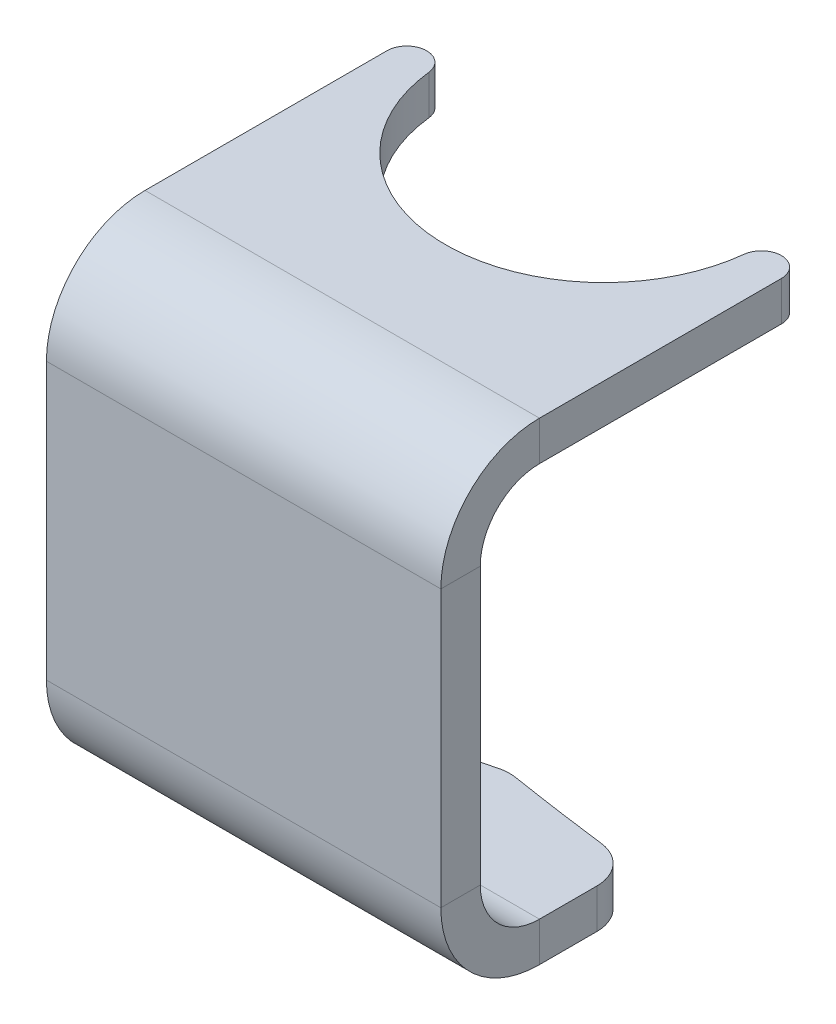
ISO-10303-21;
HEADER;
FILE_DESCRIPTION(('STEP AP214'),'2;1');
FILE_NAME('part.step','',(''),(''),'','','');
FILE_SCHEMA(('AUTOMOTIVE_DESIGN { 1 0 10303 214 1 1 1 1 }'));
ENDSEC;
DATA;
#1=APPLICATION_CONTEXT('core data for automotive mechanical design processes');
#2=APPLICATION_PROTOCOL_DEFINITION('international standard','automotive_design',2000,#1);
#3=PRODUCT_CONTEXT('',#1,'mechanical');
#4=PRODUCT('Part','Part','',(#3));
#5=PRODUCT_RELATED_PRODUCT_CATEGORY('part','',(#4));
#6=PRODUCT_DEFINITION_FORMATION('','',#4);
#7=PRODUCT_DEFINITION_CONTEXT('part definition',#1,'design');
#8=PRODUCT_DEFINITION('design','',#6,#7);
#9=PRODUCT_DEFINITION_SHAPE('','',#8);
#10=(LENGTH_UNIT() NAMED_UNIT(*) SI_UNIT(.MILLI.,.METRE.));
#11=(NAMED_UNIT(*) PLANE_ANGLE_UNIT() SI_UNIT($,.RADIAN.));
#12=(NAMED_UNIT(*) SI_UNIT($,.STERADIAN.) SOLID_ANGLE_UNIT());
#13=UNCERTAINTY_MEASURE_WITH_UNIT(LENGTH_MEASURE(1.E-05),#10,'distance_accuracy_value','');
#14=(GEOMETRIC_REPRESENTATION_CONTEXT(3) GLOBAL_UNCERTAINTY_ASSIGNED_CONTEXT((#13)) GLOBAL_UNIT_ASSIGNED_CONTEXT((#10,
#11,#12)) REPRESENTATION_CONTEXT('',''));
#15=CARTESIAN_POINT('',(0.,0.,0.));
#16=DIRECTION('',(0.,0.,1.));
#17=DIRECTION('',(1.,0.,0.));
#18=AXIS2_PLACEMENT_3D('',#15,#16,#17);
#19=CARTESIAN_POINT('',(15.875,15.5575000000001,-52.8094011308138));
#20=CARTESIAN_POINT('',(15.875,15.6633333333336,-52.8094011308149));
#21=CARTESIAN_POINT('',(15.875,15.7691666666666,-52.8094011306934));
#22=CARTESIAN_POINT('',(15.875,16.9333333333345,-52.8094011307177));
#23=CARTESIAN_POINT('',(15.875,17.991666666664,-52.8094011308602));
#24=CARTESIAN_POINT('',(15.875,19.1558333333337,-52.8094011308844));
#25=CARTESIAN_POINT('',(15.875,19.2616666666665,-52.8094011308818));
#26=CARTESIAN_POINT('',(15.875,19.3675000000001,-52.8094011308829));
#27=CARTESIAN_POINT('',(15.8750000000818,15.5575000000001,-55.6845055560318));
#28=CARTESIAN_POINT('',(15.8750000000809,15.6633333333336,-55.6845055560325));
#29=CARTESIAN_POINT('',(15.8750000002235,15.7691666666663,-55.6845055561596));
#30=CARTESIAN_POINT('',(15.8750000001932,16.9333333333043,-55.6845055561313));
#31=CARTESIAN_POINT('',(15.8750000000289,17.991666666664,-55.6845055559849));
#32=CARTESIAN_POINT('',(15.8749999999986,19.1558333333337,-55.6845055559567));
#33=CARTESIAN_POINT('',(15.8750000000014,19.2616666666665,-55.6845055559581));
#34=CARTESIAN_POINT('',(15.8750000000005,19.3675000000001,-55.6845055559585));
#35=CARTESIAN_POINT('',(13.0043748022879,15.5575000000001,-55.8449313320533));
#36=CARTESIAN_POINT('',(13.0043748022864,15.6633333333336,-55.8449313320537));
#37=CARTESIAN_POINT('',(13.004374802209,15.7691666666663,-55.8449313322153));
#38=CARTESIAN_POINT('',(13.0043748022272,16.9333333333043,-55.844931332183));
#39=CARTESIAN_POINT('',(13.0043748023171,17.9916666666622,-55.8449313319905));
#40=CARTESIAN_POINT('',(13.0043748023342,19.1558333333339,-55.8449313319582));
#41=CARTESIAN_POINT('',(13.004374802332,19.2616666666664,-55.8449313319594));
#42=CARTESIAN_POINT('',(13.0043748023331,19.3675000000001,-55.8449313319601));
#43=CARTESIAN_POINT('',(12.6840231163649,15.5575000000001,-52.9877298597671));
#44=CARTESIAN_POINT('',(12.6840231163649,15.6633333333336,-52.9877298597671));
#45=CARTESIAN_POINT('',(12.6840231163542,15.7691666666666,-52.987729859672));
#46=CARTESIAN_POINT('',(12.6840231163565,16.9333333333345,-52.987729859692));
#47=CARTESIAN_POINT('',(12.6840231163689,17.9916666666622,-52.9877298598028));
#48=CARTESIAN_POINT('',(12.6840231163711,19.1558333333339,-52.9877298598229));
#49=CARTESIAN_POINT('',(12.6840231163708,19.2616666666664,-52.9877298598202));
#50=CARTESIAN_POINT('',(12.684023116371,19.3675000000001,-52.9877298598217));
#51=(BOUNDED_SURFACE() B_SPLINE_SURFACE(3,3,((#19,#20,#21,#22,#23,#24,#25,#26),(#27,#28,#29,#30,
#31,#32,#33,#34),(#35,#36,#37,#38,#39,#40,#41,#42),(#43,#44,#45,#46,#47,#48,#49,#50)),
.UNSPECIFIED.,.F.,.F.,.F.) B_SPLINE_SURFACE_WITH_KNOTS((4,4),(4,2,2,4),(0.,1.),
(-0.0999999999999892,0.,1.,1.1),
.UNSPECIFIED.) GEOMETRIC_REPRESENTATION_ITEM() RATIONAL_B_SPLINE_SURFACE(((1.,1.,1.,1.,1.,1.,1.,
1.),(0.370532162132682,0.370532162132682,0.370532162104608,0.370532162116241,0.370532162148339,
0.370532162148339,0.370532162148506,0.370532162148506),(0.370532162132682,0.370532162132682,
0.370532162104608,0.370532162116241,0.370532162148339,0.370532162148339,0.370532162148506,
0.370532162148506),(1.,1.,1.,1.,1.,1.,1.,1.))) REPRESENTATION_ITEM('') SURFACE());
#52=CARTESIAN_POINT('',(12.6840231163649,15.5575000000001,-52.9877298597671));
#53=CARTESIAN_POINT('',(12.6840231163649,15.6633333333336,-52.9877298597671));
#54=CARTESIAN_POINT('',(12.6840231163542,15.7691666666666,-52.987729859672));
#55=CARTESIAN_POINT('',(12.6840231163565,16.9333333333345,-52.987729859692));
#56=CARTESIAN_POINT('',(12.6840231163689,17.9916666666622,-52.9877298598028));
#57=CARTESIAN_POINT('',(12.6840231163711,19.1558333333339,-52.9877298598229));
#58=CARTESIAN_POINT('',(12.6840231163708,19.2616666666664,-52.9877298598202));
#59=CARTESIAN_POINT('',(12.684023116371,19.3675000000001,-52.9877298598217));
#60=(BOUNDED_CURVE() B_SPLINE_CURVE(3,(#52,#53,#54,#55,#56,#57,#58,#59),.UNSPECIFIED.,.F.,
.F.) B_SPLINE_CURVE_WITH_KNOTS((4,2,2,4),(-0.0999999999999892,0.,1.,1.1),
.UNSPECIFIED.) CURVE() GEOMETRIC_REPRESENTATION_ITEM() RATIONAL_B_SPLINE_CURVE((1.,1.,1.,1.,1.,
1.,1.,1.)) REPRESENTATION_ITEM(''));
#61=CARTESIAN_POINT('',(12.6840231163709,19.0500000000001,-52.9877298598211));
#62=VERTEX_POINT('',#61);
#63=CARTESIAN_POINT('',(12.6840231163544,15.8750000000001,-52.9877298596738));
#64=VERTEX_POINT('',#63);
#65=EDGE_CURVE('E500',#62,#64,#60,.F.);
#66=CARTESIAN_POINT('',(12.6840231163709,19.0500000000001,-52.9877298598211));
#67=CARTESIAN_POINT('',(13.0043748023327,19.0500000000001,-55.8449313319611));
#68=CARTESIAN_POINT('',(15.8750000000013,19.0500000000001,-55.6845055559592));
#69=CARTESIAN_POINT('',(15.875,19.0500000000001,-52.8094011308822));
#70=(BOUNDED_CURVE() B_SPLINE_CURVE(3,(#66,#67,#68,#69),.UNSPECIFIED.,.F.,
.F.) B_SPLINE_CURVE_WITH_KNOTS((4,4),(0.,1.),
.UNSPECIFIED.) CURVE() GEOMETRIC_REPRESENTATION_ITEM() RATIONAL_B_SPLINE_CURVE((1.,
0.370532162148339,0.370532162148339,1.)) REPRESENTATION_ITEM(''));
#71=CARTESIAN_POINT('',(15.875,19.0500000000001,-52.8094011308822));
#72=VERTEX_POINT('',#71);
#73=EDGE_CURVE('E496',#72,#62,#70,.F.);
#74=CARTESIAN_POINT('',(15.875,19.3675000000001,-52.8094011308829));
#75=CARTESIAN_POINT('',(15.875,19.2616666666665,-52.8094011308818));
#76=CARTESIAN_POINT('',(15.875,19.1558333333337,-52.8094011308844));
#77=CARTESIAN_POINT('',(15.875,17.991666666664,-52.8094011308602));
#78=CARTESIAN_POINT('',(15.875,16.9333333333345,-52.8094011307177));
#79=CARTESIAN_POINT('',(15.875,15.7691666666666,-52.8094011306934));
#80=CARTESIAN_POINT('',(15.875,15.6633333333336,-52.8094011308149));
#81=CARTESIAN_POINT('',(15.875,15.5575000000001,-52.8094011308138));
#82=(BOUNDED_CURVE() B_SPLINE_CURVE(3,(#74,#75,#76,#77,#78,#79,#80,#81),.UNSPECIFIED.,.F.,
.F.) B_SPLINE_CURVE_WITH_KNOTS((4,2,2,4),(-0.0999999999999892,0.,1.,1.1),
.UNSPECIFIED.) CURVE() GEOMETRIC_REPRESENTATION_ITEM() RATIONAL_B_SPLINE_CURVE((1.,1.,1.,1.,1.,
1.,1.,1.)) REPRESENTATION_ITEM(''));
#83=CARTESIAN_POINT('',(15.875,15.8750000000001,-52.8094011306956));
#84=VERTEX_POINT('',#83);
#85=EDGE_CURVE('E325',#84,#72,#82,.F.);
#86=CARTESIAN_POINT('',(15.875,15.8750000000001,-52.8094011306956));
#87=CARTESIAN_POINT('',(15.8750000002207,15.8750000000001,-55.684505556157));
#88=CARTESIAN_POINT('',(13.0043748022106,15.8750000000001,-55.8449313322124));
#89=CARTESIAN_POINT('',(12.6840231163544,15.8750000000001,-52.9877298596738));
#90=(BOUNDED_CURVE() B_SPLINE_CURVE(3,(#86,#87,#88,#89),.UNSPECIFIED.,.F.,
.F.) B_SPLINE_CURVE_WITH_KNOTS((4,4),(0.,1.),
.UNSPECIFIED.) CURVE() GEOMETRIC_REPRESENTATION_ITEM() RATIONAL_B_SPLINE_CURVE((1.,
0.370532162105666,0.370532162105666,1.)) REPRESENTATION_ITEM(''));
#91=EDGE_CURVE('E488',#64,#84,#90,.F.);
#92=ORIENTED_EDGE('',*,*,#65,.F.);
#93=ORIENTED_EDGE('',*,*,#73,.F.);
#94=ORIENTED_EDGE('',*,*,#85,.F.);
#95=ORIENTED_EDGE('',*,*,#91,.F.);
#96=EDGE_LOOP('',(#92,#93,#94,#95));
#97=FACE_BOUND('',#96,.T.);
#98=ADVANCED_FACE('F87',(#97),#51,.T.);
#99=CARTESIAN_POINT('',(-15.875,19.3675,-52.8094011308833));
#100=CARTESIAN_POINT('',(-15.875,19.2616666666665,-52.8094011308036));
#101=CARTESIAN_POINT('',(-15.875,19.1558333333337,-52.8094011309626));
#102=CARTESIAN_POINT('',(-15.875,17.991666666664,-52.8094011300902));
#103=CARTESIAN_POINT('',(-15.875,16.9333333333363,-52.8094011239826));
#104=CARTESIAN_POINT('',(-15.875,15.7691666666665,-52.8094011231101));
#105=CARTESIAN_POINT('',(-15.875,15.6633333333347,-52.8094011281098));
#106=CARTESIAN_POINT('',(-15.875,15.5575000000006,-52.8094011280305));
#107=CARTESIAN_POINT('',(-15.875,19.3675000000001,-55.6845055559581));
#108=CARTESIAN_POINT('',(-15.8750000000942,19.2616666666665,-55.6845055560385));
#109=CARTESIAN_POINT('',(-15.8749999999069,19.1558333333233,-55.6845055558736));
#110=CARTESIAN_POINT('',(-15.8750000009308,17.9916666656205,-55.6845055568026));
#111=CARTESIAN_POINT('',(-15.8750000081149,16.9333333323012,-55.6845055632712));
#112=CARTESIAN_POINT('',(-15.8750000091388,15.7691666666561,-55.6845055641962));
#113=CARTESIAN_POINT('',(-15.8750000032605,15.6633333333347,-55.6845055588985));
#114=CARTESIAN_POINT('',(-15.8750000033541,15.5575000000006,-55.6845055589815));
#115=CARTESIAN_POINT('',(-13.0043748023334,19.3675000000001,-55.8449313319596));
#116=CARTESIAN_POINT('',(-13.0043748022836,19.2616666666664,-55.844931332065));
#117=CARTESIAN_POINT('',(-13.0043748023865,19.1558333333235,-55.8449313318535));
#118=CARTESIAN_POINT('',(-13.0043748018019,17.9916666656186,-55.8449313330208));
#119=CARTESIAN_POINT('',(-13.0043747978229,16.9333333323012,-55.8449313412512));
#120=CARTESIAN_POINT('',(-13.0043747972504,15.7691666666561,-55.8449313424265));
#121=CARTESIAN_POINT('',(-13.0043748005173,15.6633333333347,-55.8449313356942));
#122=CARTESIAN_POINT('',(-13.0043748004679,15.5575000000006,-55.8449313358011));
#123=CARTESIAN_POINT('',(-12.684023116371,19.3675,-52.987729859822));
#124=CARTESIAN_POINT('',(-12.6840231163641,19.2616666666664,-52.987729859761));
#125=CARTESIAN_POINT('',(-12.6840231163781,19.1558333333339,-52.9877298598855));
#126=CARTESIAN_POINT('',(-12.6840231162998,17.9916666666622,-52.9877298591868));
#127=CARTESIAN_POINT('',(-12.6840231157603,16.9333333333382,-52.9877298543751));
#128=CARTESIAN_POINT('',(-12.6840231156828,15.7691666666663,-52.9877298536843));
#129=CARTESIAN_POINT('',(-12.6840231161253,15.6633333333348,-52.9877298576304));
#130=CARTESIAN_POINT('',(-12.6840231161184,15.5575000000006,-52.9877298575695));
#131=(BOUNDED_SURFACE() B_SPLINE_SURFACE(3,3,((#99,#100,#101,#102,#103,#104,#105,#106),(#107,
#108,#109,#110,#111,#112,#113,#114),(#115,#116,#117,#118,#119,#120,#121,#122),(#123,#124,#125,
#126,#127,#128,#129,#130)),.UNSPECIFIED.,.F.,.F.,.F.) B_SPLINE_SURFACE_WITH_KNOTS((4,4),(4,2,2,
4),(0.,1.),(-0.0999999999999853,0.,0.999999999999853,1.09999999999984),
.UNSPECIFIED.) GEOMETRIC_REPRESENTATION_ITEM() RATIONAL_B_SPLINE_SURFACE(((1.,1.,1.,1.,1.,1.,1.,
1.),(0.3705321621486,0.3705321621486,0.370532162185136,0.370532161783238,0.370532160751556,
0.37053216035289,0.370532161496201,0.370532161496201),(0.3705321621486,0.3705321621486,
0.370532162185136,0.370532161783238,0.370532160751556,0.37053216035289,0.370532161496201,
0.370532161496201),(1.,1.,1.,1.,1.,1.,1.,1.))) REPRESENTATION_ITEM('') SURFACE());
#132=CARTESIAN_POINT('',(-15.875,15.5575000000006,-52.8094011280305));
#133=CARTESIAN_POINT('',(-15.875,15.6633333333347,-52.8094011281098));
#134=CARTESIAN_POINT('',(-15.875,15.7691666666665,-52.8094011231101));
#135=CARTESIAN_POINT('',(-15.875,16.9333333333363,-52.8094011239826));
#136=CARTESIAN_POINT('',(-15.875,17.991666666664,-52.8094011300902));
#137=CARTESIAN_POINT('',(-15.875,19.1558333333337,-52.8094011309626));
#138=CARTESIAN_POINT('',(-15.875,19.2616666666665,-52.8094011308036));
#139=CARTESIAN_POINT('',(-15.875,19.3675,-52.8094011308833));
#140=(BOUNDED_CURVE() B_SPLINE_CURVE(3,(#132,#133,#134,#135,#136,#137,#138,#139),.UNSPECIFIED.,
.F.,.F.) B_SPLINE_CURVE_WITH_KNOTS((4,2,2,4),(-0.0999999999999852,0.,0.999999999999853,
1.09999999999984),
.UNSPECIFIED.) CURVE() GEOMETRIC_REPRESENTATION_ITEM() RATIONAL_B_SPLINE_CURVE((1.,1.,1.,1.,1.,
1.,1.,1.)) REPRESENTATION_ITEM(''));
#141=CARTESIAN_POINT('',(-15.875,19.0500000000001,-52.8094011308833));
#142=VERTEX_POINT('',#141);
#143=CARTESIAN_POINT('',(-15.875,15.8750000000001,-52.8094011231894));
#144=VERTEX_POINT('',#143);
#145=EDGE_CURVE('E422',#142,#144,#140,.F.);
#146=CARTESIAN_POINT('',(-15.875,19.0500000000001,-52.8094011308833));
#147=CARTESIAN_POINT('',(-15.875,19.0500000000001,-55.6845055559581));
#148=CARTESIAN_POINT('',(-13.0043748023334,19.0500000000001,-55.8449313319596));
#149=CARTESIAN_POINT('',(-12.684023116371,19.0500000000001,-52.987729859822));
#150=(BOUNDED_CURVE() B_SPLINE_CURVE(3,(#146,#147,#148,#149),.UNSPECIFIED.,.F.,
.F.) B_SPLINE_CURVE_WITH_KNOTS((4,4),(0.,1.),
.UNSPECIFIED.) CURVE() GEOMETRIC_REPRESENTATION_ITEM() RATIONAL_B_SPLINE_CURVE((1.,
0.3705321621486,0.3705321621486,1.)) REPRESENTATION_ITEM(''));
#151=CARTESIAN_POINT('',(-12.684023116371,19.0500000000001,-52.987729859822));
#152=VERTEX_POINT('',#151);
#153=EDGE_CURVE('E590',#152,#142,#150,.F.);
#154=CARTESIAN_POINT('',(-12.684023116371,19.3675,-52.987729859822));
#155=CARTESIAN_POINT('',(-12.6840231163641,19.2616666666664,-52.987729859761));
#156=CARTESIAN_POINT('',(-12.6840231163781,19.1558333333339,-52.9877298598855));
#157=CARTESIAN_POINT('',(-12.6840231162998,17.9916666666622,-52.9877298591868));
#158=CARTESIAN_POINT('',(-12.6840231157603,16.9333333333382,-52.9877298543751));
#159=CARTESIAN_POINT('',(-12.6840231156828,15.7691666666663,-52.9877298536843));
#160=CARTESIAN_POINT('',(-12.6840231161253,15.6633333333348,-52.9877298576304));
#161=CARTESIAN_POINT('',(-12.6840231161184,15.5575000000006,-52.9877298575695));
#162=(BOUNDED_CURVE() B_SPLINE_CURVE(3,(#154,#155,#156,#157,#158,#159,#160,#161),.UNSPECIFIED.,
.F.,.F.) B_SPLINE_CURVE_WITH_KNOTS((4,2,2,4),(-0.0999999999999853,0.,0.999999999999853,
1.09999999999984),
.UNSPECIFIED.) CURVE() GEOMETRIC_REPRESENTATION_ITEM() RATIONAL_B_SPLINE_CURVE((1.,1.,1.,1.,1.,
1.,1.,1.)) REPRESENTATION_ITEM(''));
#163=CARTESIAN_POINT('',(-12.6840231156899,15.8750000000001,-52.9877298537471));
#164=VERTEX_POINT('',#163);
#165=EDGE_CURVE('E424',#164,#152,#162,.F.);
#166=CARTESIAN_POINT('',(-12.6840231156899,15.8750000000001,-52.9877298537471));
#167=CARTESIAN_POINT('',(-13.0043747973025,15.8750000000001,-55.8449313423197));
#168=CARTESIAN_POINT('',(-15.8750000090457,15.8750000000001,-55.6845055641121));
#169=CARTESIAN_POINT('',(-15.875,15.8750000000001,-52.8094011231894));
#170=(BOUNDED_CURVE() B_SPLINE_CURVE(3,(#166,#167,#168,#169),.UNSPECIFIED.,.F.,
.F.) B_SPLINE_CURVE_WITH_KNOTS((4,4),(0.,1.),
.UNSPECIFIED.) CURVE() GEOMETRIC_REPRESENTATION_ITEM() RATIONAL_B_SPLINE_CURVE((1.,
0.370532160389132,0.370532160389132,1.)) REPRESENTATION_ITEM(''));
#171=EDGE_CURVE('E589',#144,#164,#170,.F.);
#172=ORIENTED_EDGE('',*,*,#145,.F.);
#173=ORIENTED_EDGE('',*,*,#153,.F.);
#174=ORIENTED_EDGE('',*,*,#165,.F.);
#175=ORIENTED_EDGE('',*,*,#171,.F.);
#176=EDGE_LOOP('',(#172,#173,#174,#175));
#177=FACE_BOUND('',#176,.T.);
#178=ADVANCED_FACE('F386',(#177),#131,.T.);
#179=CARTESIAN_POINT('',(-12.6840231163709,-19.3675000000001,-52.9877298598216));
#180=CARTESIAN_POINT('',(-12.6840231163709,-19.2616666666665,-52.9877298598216));
#181=CARTESIAN_POINT('',(-12.6840231163709,-19.1558333333337,-52.9877298598211));
#182=CARTESIAN_POINT('',(-12.6840231163709,-17.9916666666639,-52.9877298598211));
#183=CARTESIAN_POINT('',(-12.6840231163704,-16.9333333333383,-52.9877298598166));
#184=CARTESIAN_POINT('',(-12.6840231163704,-15.7691666666663,-52.9877298598166));
#185=CARTESIAN_POINT('',(-12.6840231163708,-15.6633333333343,-52.98772985982));
#186=CARTESIAN_POINT('',(-12.6840231163708,-15.5575000000004,-52.98772985982));
#187=CARTESIAN_POINT('',(-13.0043748023331,-19.3675000000001,-55.8449313319602));
#188=CARTESIAN_POINT('',(-13.0043748023331,-19.2616666666665,-55.8449313319602));
#189=CARTESIAN_POINT('',(-13.0043748023326,-19.1558333333337,-55.8449313319612));
#190=CARTESIAN_POINT('',(-13.0043748023326,-17.991666666664,-55.8449313319612));
#191=CARTESIAN_POINT('',(-13.0043748023289,-16.9333333333383,-55.8449313319687));
#192=CARTESIAN_POINT('',(-13.0043748023289,-15.7691666666663,-55.8449313319687));
#193=CARTESIAN_POINT('',(-13.0043748023317,-15.6633333333343,-55.844931331963));
#194=CARTESIAN_POINT('',(-13.0043748023317,-15.5575000000004,-55.844931331963));
#195=CARTESIAN_POINT('',(-15.8750000000005,-19.3675000000001,-55.6845055559585));
#196=CARTESIAN_POINT('',(-15.8750000000005,-19.2616666666665,-55.6845055559585));
#197=CARTESIAN_POINT('',(-15.8750000000013,-19.1558333333337,-55.6845055559593));
#198=CARTESIAN_POINT('',(-15.8750000000013,-17.991666666664,-55.6845055559593));
#199=CARTESIAN_POINT('',(-15.875000000008,-16.9333333333383,-55.6845055559652));
#200=CARTESIAN_POINT('',(-15.875000000008,-15.7691666666663,-55.6845055559652));
#201=CARTESIAN_POINT('',(-15.8750000000029,-15.6633333333343,-55.6845055559607));
#202=CARTESIAN_POINT('',(-15.8750000000029,-15.5575000000004,-55.6845055559607));
#203=CARTESIAN_POINT('',(-15.875,-19.3675000000001,-52.8094011308829));
#204=CARTESIAN_POINT('',(-15.875,-19.2616666666665,-52.8094011308829));
#205=CARTESIAN_POINT('',(-15.875,-19.1558333333337,-52.8094011308822));
#206=CARTESIAN_POINT('',(-15.875,-17.9916666666639,-52.8094011308822));
#207=CARTESIAN_POINT('',(-15.875,-16.9333333333383,-52.8094011308766));
#208=CARTESIAN_POINT('',(-15.875,-15.7691666666663,-52.8094011308766));
#209=CARTESIAN_POINT('',(-15.875,-15.6633333333343,-52.8094011308808));
#210=CARTESIAN_POINT('',(-15.875,-15.5575000000004,-52.8094011308808));
#211=(BOUNDED_SURFACE() B_SPLINE_SURFACE(3,3,((#179,#180,#181,#182,#183,#184,#185,#186),(#187,
#188,#189,#190,#191,#192,#193,#194),(#195,#196,#197,#198,#199,#200,#201,#202),(#203,#204,#205,
#206,#207,#208,#209,#210)),.UNSPECIFIED.,.F.,.F.,.F.) B_SPLINE_SURFACE_WITH_KNOTS((4,4),(4,2,2,
4),(0.,1.),(-0.0999999999999922,0.,0.999999999999922,1.09999999999991),
.UNSPECIFIED.) GEOMETRIC_REPRESENTATION_ITEM() RATIONAL_B_SPLINE_SURFACE(((1.,1.,1.,1.,1.,1.,1.,
1.),(0.370532162148503,0.370532162148503,0.370532162148337,0.370532162148337,0.37053216214705,
0.37053216214705,0.370532162148028,0.370532162148028),(0.370532162148503,0.370532162148503,
0.370532162148337,0.370532162148337,0.37053216214705,0.37053216214705,0.370532162148028,
0.370532162148028),(1.,1.,1.,1.,1.,1.,1.,1.))) REPRESENTATION_ITEM('') SURFACE());
#212=CARTESIAN_POINT('',(-15.875,-19.3675000000001,-52.8094011308829));
#213=CARTESIAN_POINT('',(-15.875,-19.2616666666665,-52.8094011308829));
#214=CARTESIAN_POINT('',(-15.875,-19.1558333333337,-52.8094011308822));
#215=CARTESIAN_POINT('',(-15.875,-17.9916666666639,-52.8094011308822));
#216=CARTESIAN_POINT('',(-15.875,-16.9333333333383,-52.8094011308766));
#217=CARTESIAN_POINT('',(-15.875,-15.7691666666663,-52.8094011308766));
#218=CARTESIAN_POINT('',(-15.875,-15.6633333333343,-52.8094011308808));
#219=CARTESIAN_POINT('',(-15.875,-15.5575000000004,-52.8094011308808));
#220=(BOUNDED_CURVE() B_SPLINE_CURVE(3,(#212,#213,#214,#215,#216,#217,#218,#219),.UNSPECIFIED.,
.F.,.F.) B_SPLINE_CURVE_WITH_KNOTS((4,2,2,4),(-0.0999999999999922,0.,0.999999999999922,
1.09999999999991),
.UNSPECIFIED.) CURVE() GEOMETRIC_REPRESENTATION_ITEM() RATIONAL_B_SPLINE_CURVE((1.,1.,1.,1.,1.,
1.,1.,1.)) REPRESENTATION_ITEM(''));
#221=CARTESIAN_POINT('',(-15.875,-15.8750000000001,-52.8094011308766));
#222=VERTEX_POINT('',#221);
#223=CARTESIAN_POINT('',(-15.875,-19.0500000000001,-52.8094011308822));
#224=VERTEX_POINT('',#223);
#225=EDGE_CURVE('E249',#222,#224,#220,.F.);
#226=CARTESIAN_POINT('',(-15.875,-15.8750000000001,-52.8094011308766));
#227=CARTESIAN_POINT('',(-15.875000000008,-15.8750000000001,-55.6845055559652));
#228=CARTESIAN_POINT('',(-13.0043748023289,-15.8750000000001,-55.8449313319687));
#229=CARTESIAN_POINT('',(-12.6840231163704,-15.8750000000001,-52.9877298598166));
#230=(BOUNDED_CURVE() B_SPLINE_CURVE(3,(#226,#227,#228,#229),.UNSPECIFIED.,.F.,
.F.) B_SPLINE_CURVE_WITH_KNOTS((4,4),(0.,1.),
.UNSPECIFIED.) CURVE() GEOMETRIC_REPRESENTATION_ITEM() RATIONAL_B_SPLINE_CURVE((1.,
0.37053216214705,0.37053216214705,1.)) REPRESENTATION_ITEM(''));
#231=CARTESIAN_POINT('',(-12.6840231163704,-15.8750000000001,-52.9877298598166));
#232=VERTEX_POINT('',#231);
#233=EDGE_CURVE('E423',#232,#222,#230,.F.);
#234=CARTESIAN_POINT('',(-12.6840231163708,-15.5575000000004,-52.98772985982));
#235=CARTESIAN_POINT('',(-12.6840231163708,-15.6633333333343,-52.98772985982));
#236=CARTESIAN_POINT('',(-12.6840231163704,-15.7691666666663,-52.9877298598166));
#237=CARTESIAN_POINT('',(-12.6840231163704,-16.9333333333383,-52.9877298598166));
#238=CARTESIAN_POINT('',(-12.6840231163709,-17.9916666666639,-52.9877298598211));
#239=CARTESIAN_POINT('',(-12.6840231163709,-19.1558333333337,-52.9877298598211));
#240=CARTESIAN_POINT('',(-12.6840231163709,-19.2616666666665,-52.9877298598216));
#241=CARTESIAN_POINT('',(-12.6840231163709,-19.3675000000001,-52.9877298598216));
#242=(BOUNDED_CURVE() B_SPLINE_CURVE(3,(#234,#235,#236,#237,#238,#239,#240,#241),.UNSPECIFIED.,
.F.,.F.) B_SPLINE_CURVE_WITH_KNOTS((4,2,2,4),(-0.0999999999999922,0.,0.999999999999922,
1.09999999999991),
.UNSPECIFIED.) CURVE() GEOMETRIC_REPRESENTATION_ITEM() RATIONAL_B_SPLINE_CURVE((1.,1.,1.,1.,1.,
1.,1.,1.)) REPRESENTATION_ITEM(''));
#243=CARTESIAN_POINT('',(-12.6840231163709,-19.0500000000001,-52.9877298598211));
#244=VERTEX_POINT('',#243);
#245=EDGE_CURVE('E420',#244,#232,#242,.F.);
#246=CARTESIAN_POINT('',(-12.6840231163709,-19.0500000000001,-52.9877298598211));
#247=CARTESIAN_POINT('',(-13.0043748023326,-19.0500000000001,-55.8449313319612));
#248=CARTESIAN_POINT('',(-15.8750000000013,-19.0500000000001,-55.6845055559593));
#249=CARTESIAN_POINT('',(-15.875,-19.0500000000001,-52.8094011308822));
#250=(BOUNDED_CURVE() B_SPLINE_CURVE(3,(#246,#247,#248,#249),.UNSPECIFIED.,.F.,
.F.) B_SPLINE_CURVE_WITH_KNOTS((4,4),(0.,1.),
.UNSPECIFIED.) CURVE() GEOMETRIC_REPRESENTATION_ITEM() RATIONAL_B_SPLINE_CURVE((1.,
0.370532162148337,0.370532162148337,1.)) REPRESENTATION_ITEM(''));
#251=EDGE_CURVE('E418',#224,#244,#250,.F.);
#252=ORIENTED_EDGE('',*,*,#225,.F.);
#253=ORIENTED_EDGE('',*,*,#233,.F.);
#254=ORIENTED_EDGE('',*,*,#245,.F.);
#255=ORIENTED_EDGE('',*,*,#251,.F.);
#256=EDGE_LOOP('',(#252,#253,#254,#255));
#257=FACE_BOUND('',#256,.T.);
#258=ADVANCED_FACE('F377',(#257),#211,.T.);
#259=CARTESIAN_POINT('',(15.875,-19.05,-28.575));
#260=DIRECTION('',(-1.,0.,0.));
#261=DIRECTION('',(0.,0.,1.));
#262=AXIS2_PLACEMENT_3D('',#259,#260,#261);
#263=PLANE('',#262);
#264=DIRECTION('',(0.,0.,1.));
#265=VECTOR('',#264,1.);
#266=CARTESIAN_POINT('',(15.875,-19.0499999999999,0.));
#267=LINE('',#266,#265);
#268=CARTESIAN_POINT('',(15.875,-19.05,-37.9547551996537));
#269=VERTEX_POINT('',#268);
#270=CARTESIAN_POINT('',(15.875,-19.05,-33.3375));
#271=VERTEX_POINT('',#270);
#272=EDGE_CURVE('E243',#269,#271,#267,.T.);
#273=ORIENTED_EDGE('',*,*,#272,.F.);
#274=DIRECTION('',(0.,1.,0.));
#275=VECTOR('',#274,1.);
#276=CARTESIAN_POINT('',(15.875,-15.875,-37.9547551996537));
#277=LINE('',#276,#275);
#278=CARTESIAN_POINT('',(15.875,-15.875,-37.9547551996537));
#279=VERTEX_POINT('',#278);
#280=EDGE_CURVE('E13',#269,#279,#277,.T.);
#281=ORIENTED_EDGE('',*,*,#280,.T.);
#282=DIRECTION('',(0.,0.,-1.));
#283=VECTOR('',#282,1.);
#284=CARTESIAN_POINT('',(15.875,-15.875,-28.575));
#285=LINE('',#284,#283);
#286=CARTESIAN_POINT('',(15.875,-15.875,-33.3375));
#287=VERTEX_POINT('',#286);
#288=EDGE_CURVE('E251',#279,#287,#285,.F.);
#289=ORIENTED_EDGE('',*,*,#288,.T.);
#290=DIRECTION('',(0.,1.,0.));
#291=VECTOR('',#290,1.);
#292=CARTESIAN_POINT('',(15.875,-19.05,-33.3375));
#293=LINE('',#292,#291);
#294=EDGE_CURVE('E265',#287,#271,#293,.F.);
#295=ORIENTED_EDGE('',*,*,#294,.T.);
#296=EDGE_LOOP('',(#273,#281,#289,#295));
#297=FACE_BOUND('',#296,.T.);
#298=ADVANCED_FACE('F385',(#297),#263,.F.);
#299=CARTESIAN_POINT('',(0.,-19.0500000000001,-54.4098725507521));
#300=DIRECTION('',(0.,1.,0.));
#301=DIRECTION('',(0.,0.,1.));
#302=AXIS2_PLACEMENT_3D('',#299,#300,#301);
#303=CYLINDRICAL_SURFACE('',#302,12.7635);
#304=CARTESIAN_POINT('',(0.,-15.8750000000001,-54.4098725507521));
#305=DIRECTION('',(0.,1.,0.));
#306=DIRECTION('',(0.,0.,1.));
#307=AXIS2_PLACEMENT_3D('',#304,#305,#306);
#308=CIRCLE('',#307,12.7635);
#309=CARTESIAN_POINT('',(3.62207501743283,-15.875,-42.1711019908433));
#310=VERTEX_POINT('',#309);
#311=EDGE_CURVE('E568',#232,#310,#308,.T.);
#312=ORIENTED_EDGE('',*,*,#311,.T.);
#313=DIRECTION('',(0.,1.,0.));
#314=VECTOR('',#313,1.);
#315=CARTESIAN_POINT('',(3.62207501743283,-19.0500000000001,-42.1711019908433));
#316=LINE('',#315,#314);
#317=CARTESIAN_POINT('',(3.62207501743283,-19.0500000000001,-42.1711019908433));
#318=VERTEX_POINT('',#317);
#319=EDGE_CURVE('E110',#310,#318,#316,.F.);
#320=ORIENTED_EDGE('',*,*,#319,.T.);
#321=CARTESIAN_POINT('',(0.,-19.0500000000001,-54.4098725507521));
#322=DIRECTION('',(0.,1.,0.));
#323=DIRECTION('',(0.,0.,1.));
#324=AXIS2_PLACEMENT_3D('',#321,#322,#323);
#325=CIRCLE('',#324,12.7635);
#326=EDGE_CURVE('E557',#244,#318,#325,.T.);
#327=ORIENTED_EDGE('',*,*,#326,.F.);
#328=ORIENTED_EDGE('',*,*,#245,.T.);
#329=EDGE_LOOP('',(#312,#320,#327,#328));
#330=FACE_BOUND('',#329,.T.);
#331=ADVANCED_FACE('F365',(#330),#303,.F.);
#332=CARTESIAN_POINT('',(0.,0.,-28.575));
#333=DIRECTION('',(0.,0.,-1.));
#334=DIRECTION('',(-1.,0.,0.));
#335=AXIS2_PLACEMENT_3D('',#332,#333,#334);
#336=PLANE('',#335);
#337=DIRECTION('',(0.,1.,0.));
#338=VECTOR('',#337,1.);
#339=CARTESIAN_POINT('',(15.875,-19.05,-28.575));
#340=LINE('',#339,#338);
#341=CARTESIAN_POINT('',(15.875,-11.1125,-28.575));
#342=VERTEX_POINT('',#341);
#343=CARTESIAN_POINT('',(15.875,11.1125,-28.575));
#344=VERTEX_POINT('',#343);
#345=EDGE_CURVE('E429',#342,#344,#340,.T.);
#346=ORIENTED_EDGE('',*,*,#345,.F.);
#347=DIRECTION('',(-1.,0.,0.));
#348=VECTOR('',#347,1.);
#349=CARTESIAN_POINT('',(-15.875,-11.1125,-28.575));
#350=LINE('',#349,#348);
#351=CARTESIAN_POINT('',(-15.875,-11.1125,-28.575));
#352=VERTEX_POINT('',#351);
#353=EDGE_CURVE('E275',#352,#342,#350,.F.);
#354=ORIENTED_EDGE('',*,*,#353,.F.);
#355=DIRECTION('',(0.,-1.,0.));
#356=VECTOR('',#355,1.);
#357=CARTESIAN_POINT('',(-15.875,-19.05,-28.575));
#358=LINE('',#357,#356);
#359=CARTESIAN_POINT('',(-15.875,11.1125,-28.575));
#360=VERTEX_POINT('',#359);
#361=EDGE_CURVE('E430',#360,#352,#358,.T.);
#362=ORIENTED_EDGE('',*,*,#361,.F.);
#363=DIRECTION('',(1.,0.,0.));
#364=VECTOR('',#363,1.);
#365=CARTESIAN_POINT('',(15.875,11.1125,-28.575));
#366=LINE('',#365,#364);
#367=EDGE_CURVE('E464',#344,#360,#366,.F.);
#368=ORIENTED_EDGE('',*,*,#367,.F.);
#369=EDGE_LOOP('',(#346,#354,#362,#368));
#370=FACE_BOUND('',#369,.T.);
#371=ADVANCED_FACE('F361',(#370),#336,.T.);
#372=CARTESIAN_POINT('',(0.,0.,-25.4));
#373=DIRECTION('',(0.,0.,-1.));
#374=DIRECTION('',(-1.,0.,0.));
#375=AXIS2_PLACEMENT_3D('',#372,#373,#374);
#376=PLANE('',#375);
#377=DIRECTION('',(-1.,0.,0.));
#378=VECTOR('',#377,1.);
#379=CARTESIAN_POINT('',(-15.875,-11.1125,-25.4));
#380=LINE('',#379,#378);
#381=CARTESIAN_POINT('',(-15.875,-11.1125,-25.4));
#382=VERTEX_POINT('',#381);
#383=CARTESIAN_POINT('',(15.875,-11.1125,-25.4));
#384=VERTEX_POINT('',#383);
#385=EDGE_CURVE('E223',#382,#384,#380,.F.);
#386=ORIENTED_EDGE('',*,*,#385,.T.);
#387=DIRECTION('',(0.,1.,0.));
#388=VECTOR('',#387,1.);
#389=CARTESIAN_POINT('',(15.875,-19.05,-25.4));
#390=LINE('',#389,#388);
#391=CARTESIAN_POINT('',(15.875,11.1125,-25.4));
#392=VERTEX_POINT('',#391);
#393=EDGE_CURVE('E435',#384,#392,#390,.T.);
#394=ORIENTED_EDGE('',*,*,#393,.T.);
#395=DIRECTION('',(1.,0.,0.));
#396=VECTOR('',#395,1.);
#397=CARTESIAN_POINT('',(15.875,11.1125,-25.4));
#398=LINE('',#397,#396);
#399=CARTESIAN_POINT('',(-15.875,11.1125,-25.4));
#400=VERTEX_POINT('',#399);
#401=EDGE_CURVE('E444',#392,#400,#398,.F.);
#402=ORIENTED_EDGE('',*,*,#401,.T.);
#403=DIRECTION('',(0.,-1.,0.));
#404=VECTOR('',#403,1.);
#405=CARTESIAN_POINT('',(-15.875,-19.05,-25.4));
#406=LINE('',#405,#404);
#407=EDGE_CURVE('E439',#400,#382,#406,.T.);
#408=ORIENTED_EDGE('',*,*,#407,.T.);
#409=EDGE_LOOP('',(#386,#394,#402,#408));
#410=FACE_BOUND('',#409,.T.);
#411=ADVANCED_FACE('F364',(#410),#376,.F.);
#412=CARTESIAN_POINT('',(-15.875,-19.05,-28.575));
#413=DIRECTION('',(-1.,0.,0.));
#414=DIRECTION('',(0.,0.,1.));
#415=AXIS2_PLACEMENT_3D('',#412,#413,#414);
#416=PLANE('',#415);
#417=ORIENTED_EDGE('',*,*,#361,.T.);
#418=DIRECTION('',(0.,0.,1.));
#419=VECTOR('',#418,1.);
#420=CARTESIAN_POINT('',(-15.875,-11.1125,-28.575));
#421=LINE('',#420,#419);
#422=EDGE_CURVE('E271',#352,#382,#421,.T.);
#423=ORIENTED_EDGE('',*,*,#422,.T.);
#424=ORIENTED_EDGE('',*,*,#407,.F.);
#425=DIRECTION('',(0.,0.,1.));
#426=VECTOR('',#425,1.);
#427=CARTESIAN_POINT('',(-15.875,11.1125,-28.575));
#428=LINE('',#427,#426);
#429=EDGE_CURVE('E440',#360,#400,#428,.T.);
#430=ORIENTED_EDGE('',*,*,#429,.F.);
#431=EDGE_LOOP('',(#417,#423,#424,#430));
#432=FACE_BOUND('',#431,.T.);
#433=ADVANCED_FACE('F369',(#432),#416,.T.);
#434=CARTESIAN_POINT('',(15.875,-19.05,-28.575));
#435=DIRECTION('',(1.,0.,0.));
#436=DIRECTION('',(0.,0.,-1.));
#437=AXIS2_PLACEMENT_3D('',#434,#435,#436);
#438=PLANE('',#437);
#439=DIRECTION('',(0.,0.,1.));
#440=VECTOR('',#439,1.);
#441=CARTESIAN_POINT('',(15.875,-11.1125,-28.575));
#442=LINE('',#441,#440);
#443=EDGE_CURVE('E279',#342,#384,#442,.T.);
#444=ORIENTED_EDGE('',*,*,#443,.F.);
#445=ORIENTED_EDGE('',*,*,#345,.T.);
#446=DIRECTION('',(0.,0.,1.));
#447=VECTOR('',#446,1.);
#448=CARTESIAN_POINT('',(15.875,11.1125,-28.575));
#449=LINE('',#448,#447);
#450=EDGE_CURVE('E456',#344,#392,#449,.T.);
#451=ORIENTED_EDGE('',*,*,#450,.T.);
#452=ORIENTED_EDGE('',*,*,#393,.F.);
#453=EDGE_LOOP('',(#444,#445,#451,#452));
#454=FACE_BOUND('',#453,.T.);
#455=ADVANCED_FACE('F356',(#454),#438,.T.);
#456=CARTESIAN_POINT('',(-15.875,11.1125,-33.3375));
#457=DIRECTION('',(-1.,0.,0.));
#458=DIRECTION('',(0.,0.,1.));
#459=AXIS2_PLACEMENT_3D('',#456,#457,#458);
#460=PLANE('',#459);
#461=DIRECTION('',(0.,-1.,0.));
#462=VECTOR('',#461,1.);
#463=CARTESIAN_POINT('',(-15.875,19.05,-33.3375));
#464=LINE('',#463,#462);
#465=CARTESIAN_POINT('',(-15.875,15.875,-33.3375));
#466=VERTEX_POINT('',#465);
#467=CARTESIAN_POINT('',(-15.875,19.05,-33.3375));
#468=VERTEX_POINT('',#467);
#469=EDGE_CURVE('E282',#466,#468,#464,.F.);
#470=ORIENTED_EDGE('',*,*,#469,.F.);
#471=CARTESIAN_POINT('',(-15.875,11.1125,-33.3375));
#472=DIRECTION('',(1.,0.,0.));
#473=DIRECTION('',(0.,0.,-1.));
#474=AXIS2_PLACEMENT_3D('',#471,#472,#473);
#475=CIRCLE('',#474,4.7625);
#476=EDGE_CURVE('E461',#360,#466,#475,.F.);
#477=ORIENTED_EDGE('',*,*,#476,.F.);
#478=ORIENTED_EDGE('',*,*,#429,.T.);
#479=CARTESIAN_POINT('',(-15.875,11.1125,-33.3375));
#480=DIRECTION('',(1.,0.,0.));
#481=DIRECTION('',(0.,0.,-1.));
#482=AXIS2_PLACEMENT_3D('',#479,#480,#481);
#483=CIRCLE('',#482,7.9375);
#484=EDGE_CURVE('E452',#400,#468,#483,.F.);
#485=ORIENTED_EDGE('',*,*,#484,.T.);
#486=EDGE_LOOP('',(#470,#477,#478,#485));
#487=FACE_BOUND('',#486,.T.);
#488=ADVANCED_FACE('F353',(#487),#460,.T.);
#489=CARTESIAN_POINT('',(15.875,11.1125,-33.3375));
#490=DIRECTION('',(-1.,0.,0.));
#491=DIRECTION('',(0.,0.,1.));
#492=AXIS2_PLACEMENT_3D('',#489,#490,#491);
#493=PLANE('',#492);
#494=CARTESIAN_POINT('',(15.875,11.1125,-33.3375));
#495=DIRECTION('',(1.,0.,0.));
#496=DIRECTION('',(0.,0.,-1.));
#497=AXIS2_PLACEMENT_3D('',#494,#495,#496);
#498=CIRCLE('',#497,4.7625);
#499=CARTESIAN_POINT('',(15.875,15.875,-33.3375));
#500=VERTEX_POINT('',#499);
#501=EDGE_CURVE('E293',#500,#344,#498,.T.);
#502=ORIENTED_EDGE('',*,*,#501,.F.);
#503=DIRECTION('',(0.,-1.,0.));
#504=VECTOR('',#503,1.);
#505=CARTESIAN_POINT('',(15.875,15.875,-33.3375));
#506=LINE('',#505,#504);
#507=CARTESIAN_POINT('',(15.875,19.05,-33.3375));
#508=VERTEX_POINT('',#507);
#509=EDGE_CURVE('E459',#500,#508,#506,.F.);
#510=ORIENTED_EDGE('',*,*,#509,.T.);
#511=CARTESIAN_POINT('',(15.875,11.1125,-33.3375));
#512=DIRECTION('',(1.,0.,0.));
#513=DIRECTION('',(0.,0.,-1.));
#514=AXIS2_PLACEMENT_3D('',#511,#512,#513);
#515=CIRCLE('',#514,7.9375);
#516=EDGE_CURVE('E449',#508,#392,#515,.T.);
#517=ORIENTED_EDGE('',*,*,#516,.T.);
#518=ORIENTED_EDGE('',*,*,#450,.F.);
#519=EDGE_LOOP('',(#502,#510,#517,#518));
#520=FACE_BOUND('',#519,.T.);
#521=ADVANCED_FACE('F348',(#520),#493,.F.);
#522=CARTESIAN_POINT('',(15.875,11.1125,-33.3375));
#523=DIRECTION('',(1.,0.,0.));
#524=DIRECTION('',(0.,1.,0.));
#525=AXIS2_PLACEMENT_3D('',#522,#523,#524);
#526=CYLINDRICAL_SURFACE('',#525,7.9375);
#527=ORIENTED_EDGE('',*,*,#401,.F.);
#528=ORIENTED_EDGE('',*,*,#516,.F.);
#529=DIRECTION('',(1.,0.,0.));
#530=VECTOR('',#529,1.);
#531=CARTESIAN_POINT('',(-15.875,19.05,-33.3375));
#532=LINE('',#531,#530);
#533=EDGE_CURVE('E308',#508,#468,#532,.F.);
#534=ORIENTED_EDGE('',*,*,#533,.T.);
#535=ORIENTED_EDGE('',*,*,#484,.F.);
#536=EDGE_LOOP('',(#527,#528,#534,#535));
#537=FACE_BOUND('',#536,.T.);
#538=ADVANCED_FACE('F345',(#537),#526,.T.);
#539=CARTESIAN_POINT('',(15.875,11.1125,-33.3375));
#540=DIRECTION('',(1.,0.,0.));
#541=DIRECTION('',(0.,1.,0.));
#542=AXIS2_PLACEMENT_3D('',#539,#540,#541);
#543=CYLINDRICAL_SURFACE('',#542,4.7625);
#544=ORIENTED_EDGE('',*,*,#367,.T.);
#545=ORIENTED_EDGE('',*,*,#476,.T.);
#546=DIRECTION('',(1.,0.,0.));
#547=VECTOR('',#546,1.);
#548=CARTESIAN_POINT('',(-15.875,15.875,-33.3375));
#549=LINE('',#548,#547);
#550=EDGE_CURVE('E478',#466,#500,#549,.T.);
#551=ORIENTED_EDGE('',*,*,#550,.T.);
#552=ORIENTED_EDGE('',*,*,#501,.T.);
#553=EDGE_LOOP('',(#544,#545,#551,#552));
#554=FACE_BOUND('',#553,.T.);
#555=ADVANCED_FACE('F342',(#554),#543,.F.);
#556=CARTESIAN_POINT('',(15.875,19.0500000000001,-54.409872550752));
#557=DIRECTION('',(-1.,0.,0.));
#558=DIRECTION('',(0.,0.,1.));
#559=AXIS2_PLACEMENT_3D('',#556,#557,#558);
#560=PLANE('',#559);
#561=DIRECTION('',(0.,0.,1.));
#562=VECTOR('',#561,1.);
#563=CARTESIAN_POINT('',(15.875,15.8750000000001,-54.409872550752));
#564=LINE('',#563,#562);
#565=EDGE_CURVE('E301',#500,#84,#564,.F.);
#566=ORIENTED_EDGE('',*,*,#565,.T.);
#567=ORIENTED_EDGE('',*,*,#85,.T.);
#568=DIRECTION('',(0.,0.,-1.));
#569=VECTOR('',#568,1.);
#570=CARTESIAN_POINT('',(15.875,19.0499999999999,0.));
#571=LINE('',#570,#569);
#572=EDGE_CURVE('E294',#508,#72,#571,.T.);
#573=ORIENTED_EDGE('',*,*,#572,.F.);
#574=ORIENTED_EDGE('',*,*,#509,.F.);
#575=EDGE_LOOP('',(#566,#567,#573,#574));
#576=FACE_BOUND('',#575,.T.);
#577=ADVANCED_FACE('F331',(#576),#560,.F.);
#578=CARTESIAN_POINT('',(-15.875,19.05,-28.575));
#579=DIRECTION('',(1.,0.,0.));
#580=DIRECTION('',(0.,0.,-1.));
#581=AXIS2_PLACEMENT_3D('',#578,#579,#580);
#582=PLANE('',#581);
#583=DIRECTION('',(0.,0.,1.));
#584=VECTOR('',#583,1.);
#585=CARTESIAN_POINT('',(-15.875,19.0499999999999,0.));
#586=LINE('',#585,#584);
#587=EDGE_CURVE('E290',#142,#468,#586,.T.);
#588=ORIENTED_EDGE('',*,*,#587,.F.);
#589=ORIENTED_EDGE('',*,*,#145,.T.);
#590=DIRECTION('',(0.,0.,-1.));
#591=VECTOR('',#590,1.);
#592=CARTESIAN_POINT('',(-15.875,15.875,-28.575));
#593=LINE('',#592,#591);
#594=EDGE_CURVE('E299',#144,#466,#593,.F.);
#595=ORIENTED_EDGE('',*,*,#594,.T.);
#596=ORIENTED_EDGE('',*,*,#469,.T.);
#597=EDGE_LOOP('',(#588,#589,#595,#596));
#598=FACE_BOUND('',#597,.T.);
#599=ADVANCED_FACE('F341',(#598),#582,.F.);
#600=CARTESIAN_POINT('',(0.,19.0499999999999,0.));
#601=DIRECTION('',(0.,-1.,0.));
#602=DIRECTION('',(0.,0.,-1.));
#603=AXIS2_PLACEMENT_3D('',#600,#601,#602);
#604=PLANE('',#603);
#605=ORIENTED_EDGE('',*,*,#572,.T.);
#606=ORIENTED_EDGE('',*,*,#73,.T.);
#607=CARTESIAN_POINT('',(0.,19.0500000000001,-54.4098725507521));
#608=DIRECTION('',(0.,1.,0.));
#609=DIRECTION('',(0.,0.,1.));
#610=AXIS2_PLACEMENT_3D('',#607,#608,#609);
#611=CIRCLE('',#610,12.7635);
#612=EDGE_CURVE('E571',#152,#62,#611,.T.);
#613=ORIENTED_EDGE('',*,*,#612,.F.);
#614=ORIENTED_EDGE('',*,*,#153,.T.);
#615=ORIENTED_EDGE('',*,*,#587,.T.);
#616=ORIENTED_EDGE('',*,*,#533,.F.);
#617=EDGE_LOOP('',(#605,#606,#613,#614,#615,#616));
#618=FACE_BOUND('',#617,.T.);
#619=ADVANCED_FACE('F482',(#618),#604,.F.);
#620=CARTESIAN_POINT('',(0.,15.8749999999999,0.));
#621=DIRECTION('',(0.,-1.,0.));
#622=DIRECTION('',(0.,0.,-1.));
#623=AXIS2_PLACEMENT_3D('',#620,#621,#622);
#624=PLANE('',#623);
#625=CARTESIAN_POINT('',(0.,15.8750000000001,-54.4098725507521));
#626=DIRECTION('',(0.,-1.,0.));
#627=DIRECTION('',(0.,0.,-1.));
#628=AXIS2_PLACEMENT_3D('',#625,#626,#627);
#629=CIRCLE('',#628,12.7635);
#630=EDGE_CURVE('E268',#64,#164,#629,.T.);
#631=ORIENTED_EDGE('',*,*,#630,.F.);
#632=ORIENTED_EDGE('',*,*,#91,.T.);
#633=ORIENTED_EDGE('',*,*,#565,.F.);
#634=ORIENTED_EDGE('',*,*,#550,.F.);
#635=ORIENTED_EDGE('',*,*,#594,.F.);
#636=ORIENTED_EDGE('',*,*,#171,.T.);
#637=EDGE_LOOP('',(#631,#632,#633,#634,#635,#636));
#638=FACE_BOUND('',#637,.T.);
#639=ADVANCED_FACE('F487',(#638),#624,.T.);
#640=CARTESIAN_POINT('',(15.875,-11.1125,-33.3375));
#641=DIRECTION('',(1.,0.,0.));
#642=DIRECTION('',(0.,0.,-1.));
#643=AXIS2_PLACEMENT_3D('',#640,#641,#642);
#644=PLANE('',#643);
#645=ORIENTED_EDGE('',*,*,#294,.F.);
#646=CARTESIAN_POINT('',(15.875,-11.1125,-33.3375));
#647=DIRECTION('',(-1.,0.,0.));
#648=DIRECTION('',(0.,0.,1.));
#649=AXIS2_PLACEMENT_3D('',#646,#647,#648);
#650=CIRCLE('',#649,4.7625);
#651=EDGE_CURVE('E226',#342,#287,#650,.F.);
#652=ORIENTED_EDGE('',*,*,#651,.F.);
#653=ORIENTED_EDGE('',*,*,#443,.T.);
#654=CARTESIAN_POINT('',(15.875,-11.1125,-33.3375));
#655=DIRECTION('',(-1.,0.,0.));
#656=DIRECTION('',(0.,0.,1.));
#657=AXIS2_PLACEMENT_3D('',#654,#655,#656);
#658=CIRCLE('',#657,7.9375);
#659=EDGE_CURVE('E270',#384,#271,#658,.F.);
#660=ORIENTED_EDGE('',*,*,#659,.T.);
#661=EDGE_LOOP('',(#645,#652,#653,#660));
#662=FACE_BOUND('',#661,.T.);
#663=ADVANCED_FACE('F647',(#662),#644,.T.);
#664=CARTESIAN_POINT('',(-15.875,-11.1125,-33.3375));
#665=DIRECTION('',(1.,0.,0.));
#666=DIRECTION('',(0.,0.,-1.));
#667=AXIS2_PLACEMENT_3D('',#664,#665,#666);
#668=PLANE('',#667);
#669=CARTESIAN_POINT('',(-15.875,-11.1125,-33.3375));
#670=DIRECTION('',(-1.,0.,0.));
#671=DIRECTION('',(0.,0.,1.));
#672=AXIS2_PLACEMENT_3D('',#669,#670,#671);
#673=CIRCLE('',#672,4.7625);
#674=CARTESIAN_POINT('',(-15.875,-15.875,-33.3375));
#675=VERTEX_POINT('',#674);
#676=EDGE_CURVE('E233',#675,#352,#673,.T.);
#677=ORIENTED_EDGE('',*,*,#676,.F.);
#678=DIRECTION('',(0.,1.,0.));
#679=VECTOR('',#678,1.);
#680=CARTESIAN_POINT('',(-15.875,-15.875,-33.3375));
#681=LINE('',#680,#679);
#682=CARTESIAN_POINT('',(-15.875,-19.05,-33.3375));
#683=VERTEX_POINT('',#682);
#684=EDGE_CURVE('E230',#675,#683,#681,.F.);
#685=ORIENTED_EDGE('',*,*,#684,.T.);
#686=CARTESIAN_POINT('',(-15.875,-11.1125,-33.3375));
#687=DIRECTION('',(-1.,0.,0.));
#688=DIRECTION('',(0.,0.,1.));
#689=AXIS2_PLACEMENT_3D('',#686,#687,#688);
#690=CIRCLE('',#689,7.9375);
#691=EDGE_CURVE('E216',#683,#382,#690,.T.);
#692=ORIENTED_EDGE('',*,*,#691,.T.);
#693=ORIENTED_EDGE('',*,*,#422,.F.);
#694=EDGE_LOOP('',(#677,#685,#692,#693));
#695=FACE_BOUND('',#694,.T.);
#696=ADVANCED_FACE('F231',(#695),#668,.F.);
#697=CARTESIAN_POINT('',(-15.875,-11.1125,-33.3375));
#698=DIRECTION('',(-1.,0.,0.));
#699=DIRECTION('',(0.,-1.,0.));
#700=AXIS2_PLACEMENT_3D('',#697,#698,#699);
#701=CYLINDRICAL_SURFACE('',#700,7.9375);
#702=ORIENTED_EDGE('',*,*,#385,.F.);
#703=ORIENTED_EDGE('',*,*,#691,.F.);
#704=DIRECTION('',(-1.,0.,0.));
#705=VECTOR('',#704,1.);
#706=CARTESIAN_POINT('',(15.875,-19.05,-33.3375));
#707=LINE('',#706,#705);
#708=EDGE_CURVE('E221',#683,#271,#707,.F.);
#709=ORIENTED_EDGE('',*,*,#708,.T.);
#710=ORIENTED_EDGE('',*,*,#659,.F.);
#711=EDGE_LOOP('',(#702,#703,#709,#710));
#712=FACE_BOUND('',#711,.T.);
#713=ADVANCED_FACE('F218',(#712),#701,.T.);
#714=CARTESIAN_POINT('',(-15.875,-11.1125,-33.3375));
#715=DIRECTION('',(-1.,0.,0.));
#716=DIRECTION('',(0.,-1.,0.));
#717=AXIS2_PLACEMENT_3D('',#714,#715,#716);
#718=CYLINDRICAL_SURFACE('',#717,4.7625);
#719=ORIENTED_EDGE('',*,*,#353,.T.);
#720=ORIENTED_EDGE('',*,*,#651,.T.);
#721=DIRECTION('',(-1.,0.,0.));
#722=VECTOR('',#721,1.);
#723=CARTESIAN_POINT('',(15.875,-15.875,-33.3375));
#724=LINE('',#723,#722);
#725=EDGE_CURVE('E238',#287,#675,#724,.T.);
#726=ORIENTED_EDGE('',*,*,#725,.T.);
#727=ORIENTED_EDGE('',*,*,#676,.T.);
#728=EDGE_LOOP('',(#719,#720,#726,#727));
#729=FACE_BOUND('',#728,.T.);
#730=ADVANCED_FACE('F802',(#729),#718,.F.);
#731=CARTESIAN_POINT('',(-15.875,-19.0500000000001,-54.409872550752));
#732=DIRECTION('',(1.,0.,0.));
#733=DIRECTION('',(0.,0.,-1.));
#734=AXIS2_PLACEMENT_3D('',#731,#732,#733);
#735=PLANE('',#734);
#736=DIRECTION('',(0.,0.,1.));
#737=VECTOR('',#736,1.);
#738=CARTESIAN_POINT('',(-15.875,-15.8750000000001,-54.409872550752));
#739=LINE('',#738,#737);
#740=EDGE_CURVE('E244',#675,#222,#739,.F.);
#741=ORIENTED_EDGE('',*,*,#740,.T.);
#742=ORIENTED_EDGE('',*,*,#225,.T.);
#743=DIRECTION('',(0.,0.,-1.));
#744=VECTOR('',#743,1.);
#745=CARTESIAN_POINT('',(-15.875,-19.0499999999999,0.));
#746=LINE('',#745,#744);
#747=EDGE_CURVE('E242',#683,#224,#746,.T.);
#748=ORIENTED_EDGE('',*,*,#747,.F.);
#749=ORIENTED_EDGE('',*,*,#684,.F.);
#750=EDGE_LOOP('',(#741,#742,#748,#749));
#751=FACE_BOUND('',#750,.T.);
#752=ADVANCED_FACE('F247',(#751),#735,.F.);
#753=CARTESIAN_POINT('',(0.,-19.0499999999999,0.));
#754=DIRECTION('',(0.,1.,0.));
#755=DIRECTION('',(0.,0.,1.));
#756=AXIS2_PLACEMENT_3D('',#753,#754,#755);
#757=PLANE('',#756);
#758=ORIENTED_EDGE('',*,*,#326,.T.);
#759=CARTESIAN_POINT('',(4.52308870336139,-19.05,-39.1266317023088));
#760=DIRECTION('',(0.,1.,0.));
#761=DIRECTION('',(0.,0.,1.));
#762=AXIS2_PLACEMENT_3D('',#759,#760,#761);
#763=CIRCLE('',#762,3.175);
#764=CARTESIAN_POINT('',(5.02866555759227,-19.0500000000001,-42.2611200249009));
#765=VERTEX_POINT('',#764);
#766=EDGE_CURVE('E95',#318,#765,#763,.F.);
#767=ORIENTED_EDGE('',*,*,#766,.T.);
#768=CARTESIAN_POINT('',(28.8557432970434,-19.0500000000001,-52.3847993097248));
#769=DIRECTION('',(0.,-1.,0.));
#770=DIRECTION('',(-0.997546498443056,0.,-0.0700070242475595));
#771=AXIS2_PLACEMENT_3D('',#768,#769,#770);
#772=ELLIPSE('',#771,59.5271381209998,12.7635);
#773=CARTESIAN_POINT('',(13.0976048569276,-19.05,-41.1047608151641));
#774=VERTEX_POINT('',#773);
#775=EDGE_CURVE('E556',#774,#765,#772,.T.);
#776=ORIENTED_EDGE('',*,*,#775,.F.);
#777=CARTESIAN_POINT('',(12.7,-19.05,-37.9547551996537));
#778=DIRECTION('',(0.,1.,0.));
#779=DIRECTION('',(0.,0.,1.));
#780=AXIS2_PLACEMENT_3D('',#777,#778,#779);
#781=CIRCLE('',#780,3.175);
#782=EDGE_CURVE('E102',#774,#269,#781,.F.);
#783=ORIENTED_EDGE('',*,*,#782,.T.);
#784=ORIENTED_EDGE('',*,*,#272,.T.);
#785=ORIENTED_EDGE('',*,*,#708,.F.);
#786=ORIENTED_EDGE('',*,*,#747,.T.);
#787=ORIENTED_EDGE('',*,*,#251,.T.);
#788=EDGE_LOOP('',(#758,#767,#776,#783,#784,#785,#786,#787));
#789=FACE_BOUND('',#788,.T.);
#790=ADVANCED_FACE('F241',(#789),#757,.F.);
#791=CARTESIAN_POINT('',(0.,-15.8749999999999,0.));
#792=DIRECTION('',(0.,1.,0.));
#793=DIRECTION('',(0.,0.,1.));
#794=AXIS2_PLACEMENT_3D('',#791,#792,#793);
#795=PLANE('',#794);
#796=CARTESIAN_POINT('',(28.8557432970434,-15.8750000000001,-52.3847993097249));
#797=DIRECTION('',(0.,-1.,0.));
#798=DIRECTION('',(-0.997546498443056,0.,-0.0700070242475595));
#799=AXIS2_PLACEMENT_3D('',#796,#797,#798);
#800=ELLIPSE('',#799,59.5271381209998,12.7635);
#801=CARTESIAN_POINT('',(13.0976048569276,-15.875,-41.1047608151642));
#802=VERTEX_POINT('',#801);
#803=CARTESIAN_POINT('',(5.02866555759227,-15.875,-42.2611200249009));
#804=VERTEX_POINT('',#803);
#805=EDGE_CURVE('E565',#802,#804,#800,.T.);
#806=ORIENTED_EDGE('',*,*,#805,.T.);
#807=CARTESIAN_POINT('',(4.52308870336139,-15.875,-39.1266317023088));
#808=DIRECTION('',(0.,1.,0.));
#809=DIRECTION('',(0.,0.,1.));
#810=AXIS2_PLACEMENT_3D('',#807,#808,#809);
#811=CIRCLE('',#810,3.175);
#812=EDGE_CURVE('E551',#804,#310,#811,.T.);
#813=ORIENTED_EDGE('',*,*,#812,.T.);
#814=ORIENTED_EDGE('',*,*,#311,.F.);
#815=ORIENTED_EDGE('',*,*,#233,.T.);
#816=ORIENTED_EDGE('',*,*,#740,.F.);
#817=ORIENTED_EDGE('',*,*,#725,.F.);
#818=ORIENTED_EDGE('',*,*,#288,.F.);
#819=CARTESIAN_POINT('',(12.7,-15.875,-37.9547551996537));
#820=DIRECTION('',(0.,1.,0.));
#821=DIRECTION('',(0.,0.,1.));
#822=AXIS2_PLACEMENT_3D('',#819,#820,#821);
#823=CIRCLE('',#822,3.175);
#824=EDGE_CURVE('E549',#279,#802,#823,.T.);
#825=ORIENTED_EDGE('',*,*,#824,.T.);
#826=EDGE_LOOP('',(#806,#813,#814,#815,#816,#817,#818,#825));
#827=FACE_BOUND('',#826,.T.);
#828=ADVANCED_FACE('F567',(#827),#795,.T.);
#829=ORIENTED_EDGE('',*,*,#612,.T.);
#830=ORIENTED_EDGE('',*,*,#65,.T.);
#831=ORIENTED_EDGE('',*,*,#630,.T.);
#832=ORIENTED_EDGE('',*,*,#165,.T.);
#833=EDGE_LOOP('',(#829,#830,#831,#832));
#834=FACE_BOUND('',#833,.T.);
#835=ADVANCED_FACE('F586',(#834),#303,.F.);
#836=DIRECTION('',(0.,-1.,0.));
#837=VECTOR('',#836,1.);
#838=SURFACE_OF_LINEAR_EXTRUSION('',#800,#837);
#839=ORIENTED_EDGE('',*,*,#775,.T.);
#840=DIRECTION('',(0.,-1.,0.));
#841=VECTOR('',#840,1.);
#842=CARTESIAN_POINT('',(5.02866555759227,-19.0500000000001,-42.2611200249009));
#843=LINE('',#842,#841);
#844=EDGE_CURVE('E546',#765,#804,#843,.F.);
#845=ORIENTED_EDGE('',*,*,#844,.T.);
#846=ORIENTED_EDGE('',*,*,#805,.F.);
#847=DIRECTION('',(0.,-1.,0.));
#848=VECTOR('',#847,1.);
#849=CARTESIAN_POINT('',(13.0976048569276,-15.875,-41.1047608151642));
#850=LINE('',#849,#848);
#851=EDGE_CURVE('E495',#802,#774,#850,.T.);
#852=ORIENTED_EDGE('',*,*,#851,.T.);
#853=EDGE_LOOP('',(#839,#845,#846,#852));
#854=FACE_BOUND('',#853,.T.);
#855=ADVANCED_FACE('F561',(#854),#838,.F.);
#856=CARTESIAN_POINT('',(4.52308870336139,-17.4625000000001,-39.1266317023088));
#857=DIRECTION('',(0.,-1.,0.));
#858=DIRECTION('',(0.,0.,-1.));
#859=AXIS2_PLACEMENT_3D('',#856,#857,#858);
#860=CYLINDRICAL_SURFACE('',#859,3.175);
#861=ORIENTED_EDGE('',*,*,#766,.F.);
#862=ORIENTED_EDGE('',*,*,#319,.F.);
#863=ORIENTED_EDGE('',*,*,#812,.F.);
#864=ORIENTED_EDGE('',*,*,#844,.F.);
#865=EDGE_LOOP('',(#861,#862,#863,#864));
#866=FACE_BOUND('',#865,.T.);
#867=ADVANCED_FACE('F520',(#866),#860,.T.);
#868=CARTESIAN_POINT('',(12.7,-17.4625,-37.9547551996537));
#869=DIRECTION('',(0.,-1.,0.));
#870=DIRECTION('',(0.,0.,-1.));
#871=AXIS2_PLACEMENT_3D('',#868,#869,#870);
#872=CYLINDRICAL_SURFACE('',#871,3.175);
#873=ORIENTED_EDGE('',*,*,#782,.F.);
#874=ORIENTED_EDGE('',*,*,#851,.F.);
#875=ORIENTED_EDGE('',*,*,#824,.F.);
#876=ORIENTED_EDGE('',*,*,#280,.F.);
#877=EDGE_LOOP('',(#873,#874,#875,#876));
#878=FACE_BOUND('',#877,.T.);
#879=ADVANCED_FACE('F89',(#878),#872,.T.);
#880=CLOSED_SHELL('',(#98,#178,#258,#298,#331,#371,#411,#433,#455,#488,#521,#538,#555,#577,#599,
#619,#639,#663,#696,#713,#730,#752,#790,#828,#835,#855,#867,#879));
#881=MANIFOLD_SOLID_BREP('B2',#880);
#882=ADVANCED_BREP_SHAPE_REPRESENTATION('',(#18,#881),#14);
#883=SHAPE_DEFINITION_REPRESENTATION(#9,#882);
ENDSEC;
END-ISO-10303-21;
